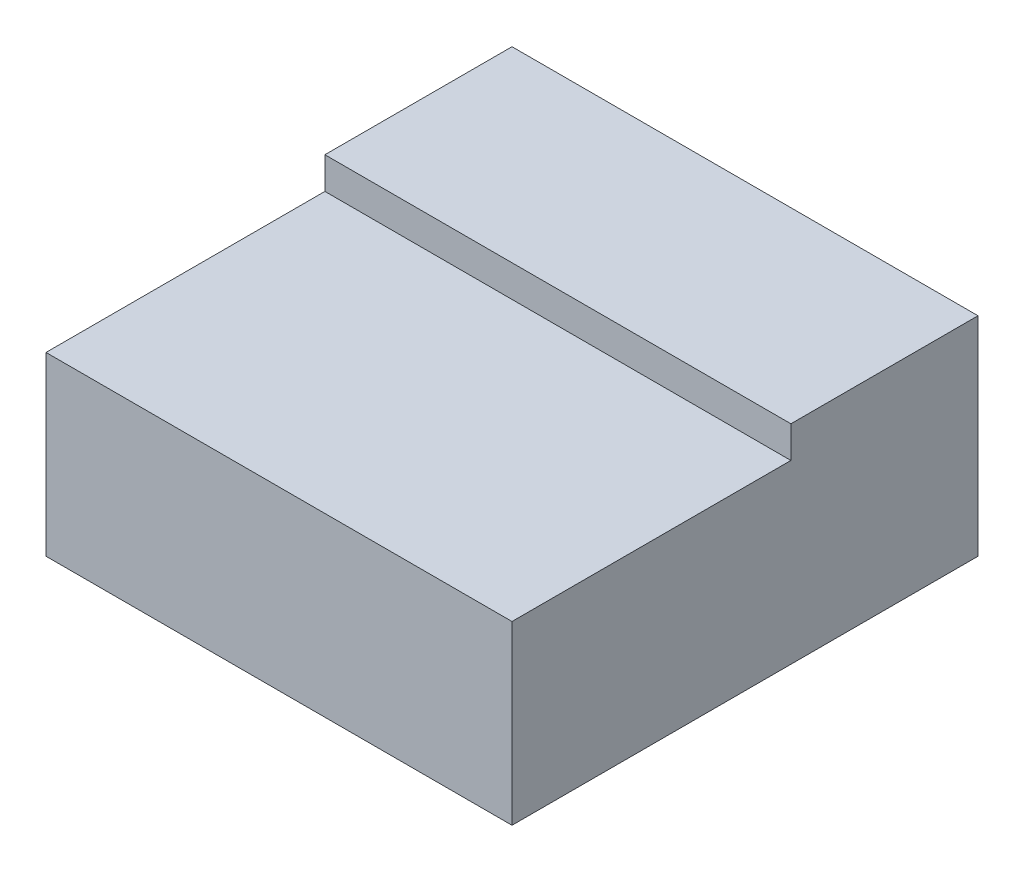
ISO-10303-21;
HEADER;
FILE_DESCRIPTION(('STEP AP214'),'2;1');
FILE_NAME('part.step','',(''),(''),'','','');
FILE_SCHEMA(('AUTOMOTIVE_DESIGN { 1 0 10303 214 1 1 1 1 }'));
ENDSEC;
DATA;
#1=APPLICATION_CONTEXT('core data for automotive mechanical design processes');
#2=APPLICATION_PROTOCOL_DEFINITION('international standard','automotive_design',2000,#1);
#3=PRODUCT_CONTEXT('',#1,'mechanical');
#4=PRODUCT('Part','Part','',(#3));
#5=PRODUCT_RELATED_PRODUCT_CATEGORY('part','',(#4));
#6=PRODUCT_DEFINITION_FORMATION('','',#4);
#7=PRODUCT_DEFINITION_CONTEXT('part definition',#1,'design');
#8=PRODUCT_DEFINITION('design','',#6,#7);
#9=PRODUCT_DEFINITION_SHAPE('','',#8);
#10=(LENGTH_UNIT() NAMED_UNIT(*) SI_UNIT(.MILLI.,.METRE.));
#11=(NAMED_UNIT(*) PLANE_ANGLE_UNIT() SI_UNIT($,.RADIAN.));
#12=(NAMED_UNIT(*) SI_UNIT($,.STERADIAN.) SOLID_ANGLE_UNIT());
#13=UNCERTAINTY_MEASURE_WITH_UNIT(LENGTH_MEASURE(1.E-05),#10,'distance_accuracy_value','');
#14=(GEOMETRIC_REPRESENTATION_CONTEXT(3) GLOBAL_UNCERTAINTY_ASSIGNED_CONTEXT((#13)) GLOBAL_UNIT_ASSIGNED_CONTEXT((#10,
#11,#12)) REPRESENTATION_CONTEXT('',''));
#15=CARTESIAN_POINT('',(0.,0.,0.));
#16=DIRECTION('',(0.,0.,1.));
#17=DIRECTION('',(1.,0.,0.));
#18=AXIS2_PLACEMENT_3D('',#15,#16,#17);
#19=CARTESIAN_POINT('',(13.2,0.,0.));
#20=DIRECTION('',(0.,0.,-1.));
#21=DIRECTION('',(-1.,0.,0.));
#22=AXIS2_PLACEMENT_3D('',#19,#20,#21);
#23=PLANE('',#22);
#24=DIRECTION('',(0.,-1.,0.));
#25=VECTOR('',#24,1.);
#26=CARTESIAN_POINT('',(0.,0.,0.));
#27=LINE('',#26,#25);
#28=CARTESIAN_POINT('',(0.,5.,0.));
#29=VERTEX_POINT('',#28);
#30=CARTESIAN_POINT('',(0.,0.,0.));
#31=VERTEX_POINT('',#30);
#32=EDGE_CURVE('E135',#29,#31,#27,.T.);
#33=ORIENTED_EDGE('',*,*,#32,.T.);
#34=DIRECTION('',(-1.,0.,0.));
#35=VECTOR('',#34,1.);
#36=CARTESIAN_POINT('',(13.2,0.,0.));
#37=LINE('',#36,#35);
#38=CARTESIAN_POINT('',(13.2,0.,0.));
#39=VERTEX_POINT('',#38);
#40=EDGE_CURVE('E13',#39,#31,#37,.T.);
#41=ORIENTED_EDGE('',*,*,#40,.F.);
#42=DIRECTION('',(0.,-1.,0.));
#43=VECTOR('',#42,1.);
#44=CARTESIAN_POINT('',(13.2,0.,0.));
#45=LINE('',#44,#43);
#46=CARTESIAN_POINT('',(13.2,5.,0.));
#47=VERTEX_POINT('',#46);
#48=EDGE_CURVE('E147',#47,#39,#45,.T.);
#49=ORIENTED_EDGE('',*,*,#48,.F.);
#50=DIRECTION('',(-1.,0.,0.));
#51=VECTOR('',#50,1.);
#52=CARTESIAN_POINT('',(13.2,5.,0.));
#53=LINE('',#52,#51);
#54=EDGE_CURVE('E131',#47,#29,#53,.T.);
#55=ORIENTED_EDGE('',*,*,#54,.T.);
#56=EDGE_LOOP('',(#33,#41,#49,#55));
#57=FACE_BOUND('',#56,.T.);
#58=ADVANCED_FACE('F48',(#57),#23,.F.);
#59=CARTESIAN_POINT('',(13.2,0.,0.));
#60=DIRECTION('',(0.,1.,0.));
#61=DIRECTION('',(0.,0.,1.));
#62=AXIS2_PLACEMENT_3D('',#59,#60,#61);
#63=PLANE('',#62);
#64=DIRECTION('',(0.,0.,-1.));
#65=VECTOR('',#64,1.);
#66=CARTESIAN_POINT('',(0.,0.,0.));
#67=LINE('',#66,#65);
#68=CARTESIAN_POINT('',(0.,0.,-13.2));
#69=VERTEX_POINT('',#68);
#70=EDGE_CURVE('E138',#31,#69,#67,.T.);
#71=ORIENTED_EDGE('',*,*,#70,.T.);
#72=DIRECTION('',(-1.,0.,0.));
#73=VECTOR('',#72,1.);
#74=CARTESIAN_POINT('',(13.2,0.,-13.2));
#75=LINE('',#74,#73);
#76=CARTESIAN_POINT('',(13.2,0.,-13.2));
#77=VERTEX_POINT('',#76);
#78=EDGE_CURVE('E56',#77,#69,#75,.T.);
#79=ORIENTED_EDGE('',*,*,#78,.F.);
#80=DIRECTION('',(0.,0.,-1.));
#81=VECTOR('',#80,1.);
#82=CARTESIAN_POINT('',(13.2,0.,0.));
#83=LINE('',#82,#81);
#84=EDGE_CURVE('E102',#39,#77,#83,.T.);
#85=ORIENTED_EDGE('',*,*,#84,.F.);
#86=ORIENTED_EDGE('',*,*,#40,.T.);
#87=EDGE_LOOP('',(#71,#79,#85,#86));
#88=FACE_BOUND('',#87,.T.);
#89=ADVANCED_FACE('F153',(#88),#63,.F.);
#90=CARTESIAN_POINT('',(13.2,5.,-13.2));
#91=DIRECTION('',(0.,0.,1.));
#92=DIRECTION('',(1.,0.,0.));
#93=AXIS2_PLACEMENT_3D('',#90,#91,#92);
#94=PLANE('',#93);
#95=CARTESIAN_POINT('',(9.6,2.95,-13.2));
#96=DIRECTION('',(0.,0.,-1.));
#97=DIRECTION('',(-1.,0.,0.));
#98=AXIS2_PLACEMENT_3D('',#95,#96,#97);
#99=CIRCLE('',#98,0.749999999999989);
#100=CARTESIAN_POINT('',(8.85000000000001,2.95,-13.2));
#101=VERTEX_POINT('',#100);
#102=EDGE_CURVE('E261',#101,#101,#99,.T.);
#103=ORIENTED_EDGE('',*,*,#102,.F.);
#104=EDGE_LOOP('',(#103));
#105=FACE_BOUND('',#104,.T.);
#106=CARTESIAN_POINT('',(3.6,2.95,-13.2));
#107=DIRECTION('',(0.,0.,-1.));
#108=DIRECTION('',(-1.,0.,0.));
#109=AXIS2_PLACEMENT_3D('',#106,#107,#108);
#110=CIRCLE('',#109,0.75);
#111=CARTESIAN_POINT('',(2.85,2.95,-13.2));
#112=VERTEX_POINT('',#111);
#113=EDGE_CURVE('E263',#112,#112,#110,.T.);
#114=ORIENTED_EDGE('',*,*,#113,.F.);
#115=EDGE_LOOP('',(#114));
#116=FACE_BOUND('',#115,.T.);
#117=DIRECTION('',(0.,1.,0.));
#118=VECTOR('',#117,1.);
#119=CARTESIAN_POINT('',(0.,5.,-13.2));
#120=LINE('',#119,#118);
#121=CARTESIAN_POINT('',(0.,5.9,-13.2));
#122=VERTEX_POINT('',#121);
#123=EDGE_CURVE('E142',#69,#122,#120,.T.);
#124=ORIENTED_EDGE('',*,*,#123,.T.);
#125=DIRECTION('',(-1.,0.,0.));
#126=VECTOR('',#125,1.);
#127=CARTESIAN_POINT('',(13.2,5.9,-13.2));
#128=LINE('',#127,#126);
#129=CARTESIAN_POINT('',(13.2,5.9,-13.2));
#130=VERTEX_POINT('',#129);
#131=EDGE_CURVE('E126',#130,#122,#128,.T.);
#132=ORIENTED_EDGE('',*,*,#131,.F.);
#133=DIRECTION('',(0.,1.,0.));
#134=VECTOR('',#133,1.);
#135=CARTESIAN_POINT('',(13.2,0.,-13.2));
#136=LINE('',#135,#134);
#137=EDGE_CURVE('E117',#77,#130,#136,.T.);
#138=ORIENTED_EDGE('',*,*,#137,.F.);
#139=ORIENTED_EDGE('',*,*,#78,.T.);
#140=EDGE_LOOP('',(#124,#132,#138,#139));
#141=FACE_BOUND('',#140,.T.);
#142=ADVANCED_FACE('F152',(#105,#116,#141),#94,.F.);
#143=CARTESIAN_POINT('',(13.2,5.9,-13.2));
#144=DIRECTION('',(0.,-1.,0.));
#145=DIRECTION('',(0.,0.,-1.));
#146=AXIS2_PLACEMENT_3D('',#143,#144,#145);
#147=PLANE('',#146);
#148=DIRECTION('',(0.,0.,1.));
#149=VECTOR('',#148,1.);
#150=CARTESIAN_POINT('',(0.,5.9,-13.2));
#151=LINE('',#150,#149);
#152=CARTESIAN_POINT('',(0.,5.9,-7.9));
#153=VERTEX_POINT('',#152);
#154=EDGE_CURVE('E125',#122,#153,#151,.T.);
#155=ORIENTED_EDGE('',*,*,#154,.T.);
#156=DIRECTION('',(-1.,0.,0.));
#157=VECTOR('',#156,1.);
#158=CARTESIAN_POINT('',(13.2,5.9,-7.9));
#159=LINE('',#158,#157);
#160=CARTESIAN_POINT('',(13.2,5.9,-7.9));
#161=VERTEX_POINT('',#160);
#162=EDGE_CURVE('E122',#161,#153,#159,.T.);
#163=ORIENTED_EDGE('',*,*,#162,.F.);
#164=DIRECTION('',(0.,0.,1.));
#165=VECTOR('',#164,1.);
#166=CARTESIAN_POINT('',(13.2,5.9,-13.2));
#167=LINE('',#166,#165);
#168=EDGE_CURVE('E111',#130,#161,#167,.T.);
#169=ORIENTED_EDGE('',*,*,#168,.F.);
#170=ORIENTED_EDGE('',*,*,#131,.T.);
#171=EDGE_LOOP('',(#155,#163,#169,#170));
#172=FACE_BOUND('',#171,.T.);
#173=ADVANCED_FACE('F123',(#172),#147,.F.);
#174=CARTESIAN_POINT('',(13.2,5.,-7.9));
#175=DIRECTION('',(0.,0.,-1.));
#176=DIRECTION('',(-1.,0.,0.));
#177=AXIS2_PLACEMENT_3D('',#174,#175,#176);
#178=PLANE('',#177);
#179=DIRECTION('',(0.,-1.,0.));
#180=VECTOR('',#179,1.);
#181=CARTESIAN_POINT('',(0.,5.,-7.9));
#182=LINE('',#181,#180);
#183=CARTESIAN_POINT('',(0.,5.,-7.9));
#184=VERTEX_POINT('',#183);
#185=EDGE_CURVE('E88',#153,#184,#182,.T.);
#186=ORIENTED_EDGE('',*,*,#185,.T.);
#187=DIRECTION('',(-1.,0.,0.));
#188=VECTOR('',#187,1.);
#189=CARTESIAN_POINT('',(13.2,5.,-7.9));
#190=LINE('',#189,#188);
#191=CARTESIAN_POINT('',(13.2,5.,-7.9));
#192=VERTEX_POINT('',#191);
#193=EDGE_CURVE('E127',#192,#184,#190,.T.);
#194=ORIENTED_EDGE('',*,*,#193,.F.);
#195=DIRECTION('',(0.,-1.,0.));
#196=VECTOR('',#195,1.);
#197=CARTESIAN_POINT('',(13.2,5.,-7.9));
#198=LINE('',#197,#196);
#199=EDGE_CURVE('E115',#161,#192,#198,.T.);
#200=ORIENTED_EDGE('',*,*,#199,.F.);
#201=ORIENTED_EDGE('',*,*,#162,.T.);
#202=EDGE_LOOP('',(#186,#194,#200,#201));
#203=FACE_BOUND('',#202,.T.);
#204=ADVANCED_FACE('F129',(#203),#178,.F.);
#205=CARTESIAN_POINT('',(13.2,5.,0.));
#206=DIRECTION('',(0.,-1.,0.));
#207=DIRECTION('',(0.,0.,-1.));
#208=AXIS2_PLACEMENT_3D('',#205,#206,#207);
#209=PLANE('',#208);
#210=DIRECTION('',(0.,0.,1.));
#211=VECTOR('',#210,1.);
#212=CARTESIAN_POINT('',(0.,5.,0.));
#213=LINE('',#212,#211);
#214=EDGE_CURVE('E94',#184,#29,#213,.T.);
#215=ORIENTED_EDGE('',*,*,#214,.T.);
#216=ORIENTED_EDGE('',*,*,#54,.F.);
#217=DIRECTION('',(0.,0.,1.));
#218=VECTOR('',#217,1.);
#219=CARTESIAN_POINT('',(13.2,5.,0.));
#220=LINE('',#219,#218);
#221=EDGE_CURVE('E64',#192,#47,#220,.T.);
#222=ORIENTED_EDGE('',*,*,#221,.F.);
#223=ORIENTED_EDGE('',*,*,#193,.T.);
#224=EDGE_LOOP('',(#215,#216,#222,#223));
#225=FACE_BOUND('',#224,.T.);
#226=ADVANCED_FACE('F160',(#225),#209,.F.);
#227=CARTESIAN_POINT('',(13.2,0.,0.));
#228=DIRECTION('',(-1.,0.,0.));
#229=DIRECTION('',(0.,0.,1.));
#230=AXIS2_PLACEMENT_3D('',#227,#228,#229);
#231=PLANE('',#230);
#232=ORIENTED_EDGE('',*,*,#48,.T.);
#233=ORIENTED_EDGE('',*,*,#84,.T.);
#234=ORIENTED_EDGE('',*,*,#137,.T.);
#235=ORIENTED_EDGE('',*,*,#168,.T.);
#236=ORIENTED_EDGE('',*,*,#199,.T.);
#237=ORIENTED_EDGE('',*,*,#221,.T.);
#238=EDGE_LOOP('',(#232,#233,#234,#235,#236,#237));
#239=FACE_BOUND('',#238,.T.);
#240=ADVANCED_FACE('F113',(#239),#231,.F.);
#241=CARTESIAN_POINT('',(0.,0.,0.));
#242=DIRECTION('',(-1.,0.,0.));
#243=DIRECTION('',(0.,0.,1.));
#244=AXIS2_PLACEMENT_3D('',#241,#242,#243);
#245=PLANE('',#244);
#246=ORIENTED_EDGE('',*,*,#32,.F.);
#247=ORIENTED_EDGE('',*,*,#214,.F.);
#248=ORIENTED_EDGE('',*,*,#185,.F.);
#249=ORIENTED_EDGE('',*,*,#154,.F.);
#250=ORIENTED_EDGE('',*,*,#123,.F.);
#251=ORIENTED_EDGE('',*,*,#70,.F.);
#252=EDGE_LOOP('',(#246,#247,#248,#249,#250,#251));
#253=FACE_BOUND('',#252,.T.);
#254=ADVANCED_FACE('F157',(#253),#245,.T.);
#255=CARTESIAN_POINT('',(3.6,2.95,-7.2));
#256=DIRECTION('',(0.,0.,-1.));
#257=DIRECTION('',(-1.,0.,0.));
#258=AXIS2_PLACEMENT_3D('',#255,#256,#257);
#259=CONICAL_SURFACE('',#258,0.749999999999999,1.02974425867665);
#260=CARTESIAN_POINT('',(3.6,2.95,-6.74935453572933));
#261=VERTEX_POINT('',#260);
#262=VERTEX_LOOP('',#261);
#263=FACE_BOUND('',#262,.T.);
#264=CARTESIAN_POINT('',(3.6,2.95,-7.2));
#265=DIRECTION('',(0.,0.,-1.));
#266=DIRECTION('',(-1.,0.,0.));
#267=AXIS2_PLACEMENT_3D('',#264,#265,#266);
#268=CIRCLE('',#267,0.749999999999999);
#269=CARTESIAN_POINT('',(2.85,2.95,-7.2));
#270=VERTEX_POINT('',#269);
#271=EDGE_CURVE('E139',#270,#270,#268,.T.);
#272=ORIENTED_EDGE('',*,*,#271,.T.);
#273=EDGE_LOOP('',(#272));
#274=FACE_BOUND('',#273,.T.);
#275=ADVANCED_FACE('F208',(#263,#274),#259,.F.);
#276=CARTESIAN_POINT('',(3.6,2.95,-13.2));
#277=DIRECTION('',(0.,0.,-1.));
#278=DIRECTION('',(-1.,0.,0.));
#279=AXIS2_PLACEMENT_3D('',#276,#277,#278);
#280=CYLINDRICAL_SURFACE('',#279,0.749999999999999);
#281=ORIENTED_EDGE('',*,*,#271,.F.);
#282=EDGE_LOOP('',(#281));
#283=FACE_BOUND('',#282,.T.);
#284=ORIENTED_EDGE('',*,*,#113,.T.);
#285=EDGE_LOOP('',(#284));
#286=FACE_BOUND('',#285,.T.);
#287=ADVANCED_FACE('F216',(#283,#286),#280,.F.);
#288=CARTESIAN_POINT('',(9.6,2.95,-7.19999999999999));
#289=DIRECTION('',(0.,0.,-1.));
#290=DIRECTION('',(-1.,0.,0.));
#291=AXIS2_PLACEMENT_3D('',#288,#289,#290);
#292=CONICAL_SURFACE('',#291,0.749999999999987,1.02974425867665);
#293=CARTESIAN_POINT('',(9.6,2.95,-6.74935453572933));
#294=VERTEX_POINT('',#293);
#295=VERTEX_LOOP('',#294);
#296=FACE_BOUND('',#295,.T.);
#297=CARTESIAN_POINT('',(9.6,2.95,-7.19999999999999));
#298=DIRECTION('',(0.,0.,-1.));
#299=DIRECTION('',(-1.,0.,0.));
#300=AXIS2_PLACEMENT_3D('',#297,#298,#299);
#301=CIRCLE('',#300,0.749999999999987);
#302=CARTESIAN_POINT('',(8.85000000000001,2.95,-7.19999999999999));
#303=VERTEX_POINT('',#302);
#304=EDGE_CURVE('E258',#303,#303,#301,.T.);
#305=ORIENTED_EDGE('',*,*,#304,.T.);
#306=EDGE_LOOP('',(#305));
#307=FACE_BOUND('',#306,.T.);
#308=ADVANCED_FACE('F225',(#296,#307),#292,.F.);
#309=CARTESIAN_POINT('',(9.6,2.95,-13.2));
#310=DIRECTION('',(0.,0.,-1.));
#311=DIRECTION('',(-1.,0.,0.));
#312=AXIS2_PLACEMENT_3D('',#309,#310,#311);
#313=CYLINDRICAL_SURFACE('',#312,0.749999999999988);
#314=ORIENTED_EDGE('',*,*,#304,.F.);
#315=EDGE_LOOP('',(#314));
#316=FACE_BOUND('',#315,.T.);
#317=ORIENTED_EDGE('',*,*,#102,.T.);
#318=EDGE_LOOP('',(#317));
#319=FACE_BOUND('',#318,.T.);
#320=ADVANCED_FACE('F241',(#316,#319),#313,.F.);
#321=CLOSED_SHELL('',(#58,#89,#142,#173,#204,#226,#240,#254,#275,#287,#308,#320));
#322=MANIFOLD_SOLID_BREP('B2',#321);
#323=ADVANCED_BREP_SHAPE_REPRESENTATION('',(#18,#322),#14);
#324=SHAPE_DEFINITION_REPRESENTATION(#9,#323);
ENDSEC;
END-ISO-10303-21;
